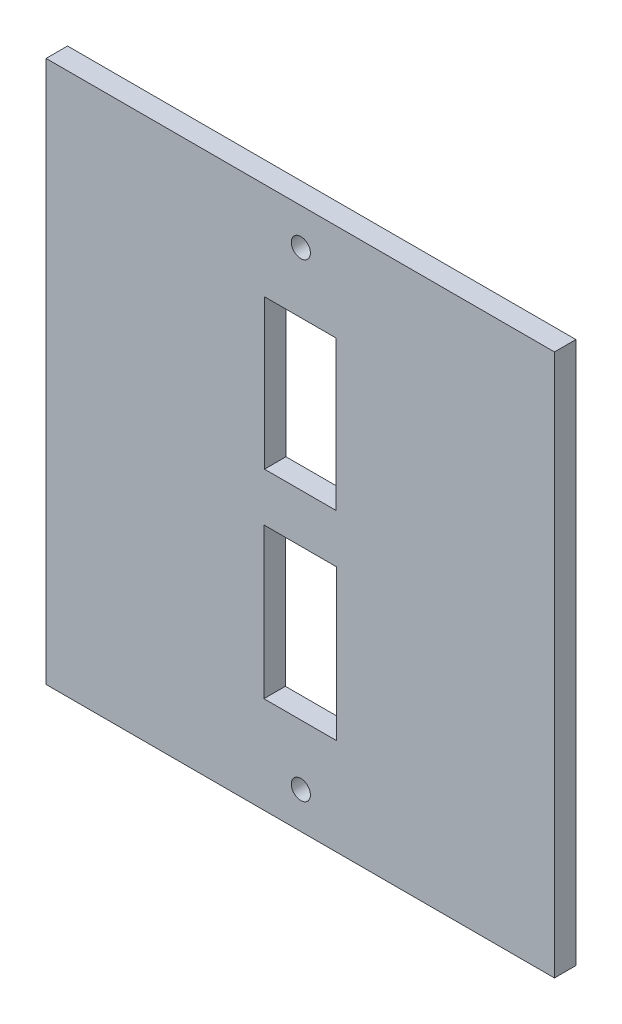
ISO-10303-21;
HEADER;
FILE_DESCRIPTION(('STEP AP214'),'2;1');
FILE_NAME('part.step','',(''),(''),'','','');
FILE_SCHEMA(('AUTOMOTIVE_DESIGN { 1 0 10303 214 1 1 1 1 }'));
ENDSEC;
DATA;
#1=APPLICATION_CONTEXT('core data for automotive mechanical design processes');
#2=APPLICATION_PROTOCOL_DEFINITION('international standard','automotive_design',2000,#1);
#3=PRODUCT_CONTEXT('',#1,'mechanical');
#4=PRODUCT('Part','Part','',(#3));
#5=PRODUCT_RELATED_PRODUCT_CATEGORY('part','',(#4));
#6=PRODUCT_DEFINITION_FORMATION('','',#4);
#7=PRODUCT_DEFINITION_CONTEXT('part definition',#1,'design');
#8=PRODUCT_DEFINITION('design','',#6,#7);
#9=PRODUCT_DEFINITION_SHAPE('','',#8);
#10=(LENGTH_UNIT() NAMED_UNIT(*) SI_UNIT(.MILLI.,.METRE.));
#11=(NAMED_UNIT(*) PLANE_ANGLE_UNIT() SI_UNIT($,.RADIAN.));
#12=(NAMED_UNIT(*) SI_UNIT($,.STERADIAN.) SOLID_ANGLE_UNIT());
#13=UNCERTAINTY_MEASURE_WITH_UNIT(LENGTH_MEASURE(1.E-05),#10,'distance_accuracy_value','');
#14=(GEOMETRIC_REPRESENTATION_CONTEXT(3) GLOBAL_UNCERTAINTY_ASSIGNED_CONTEXT((#13)) GLOBAL_UNIT_ASSIGNED_CONTEXT((#10,
#11,#12)) REPRESENTATION_CONTEXT('',''));
#15=CARTESIAN_POINT('',(0.,0.,0.));
#16=DIRECTION('',(0.,0.,1.));
#17=DIRECTION('',(1.,0.,0.));
#18=AXIS2_PLACEMENT_3D('',#15,#16,#17);
#19=CARTESIAN_POINT('',(0.,0.,3.175));
#20=DIRECTION('',(0.,0.,1.));
#21=DIRECTION('',(1.,0.,0.));
#22=AXIS2_PLACEMENT_3D('',#19,#20,#21);
#23=PLANE('',#22);
#24=CARTESIAN_POINT('',(0.0849999999999913,34.6966991411009,3.175));
#25=DIRECTION('',(0.,0.,1.));
#26=DIRECTION('',(1.,0.,0.));
#27=AXIS2_PLACEMENT_3D('',#24,#25,#26);
#28=CIRCLE('',#27,1.415);
#29=CARTESIAN_POINT('',(1.49999999999999,34.6966991411009,3.175));
#30=VERTEX_POINT('',#29);
#31=EDGE_CURVE('E314',#30,#30,#28,.T.);
#32=ORIENTED_EDGE('',*,*,#31,.F.);
#33=EDGE_LOOP('',(#32));
#34=FACE_BOUND('',#33,.T.);
#35=CARTESIAN_POINT('',(0.0849999999999998,-34.6966991411009,3.175));
#36=DIRECTION('',(0.,0.,1.));
#37=DIRECTION('',(-1.,0.,0.));
#38=AXIS2_PLACEMENT_3D('',#35,#36,#37);
#39=CIRCLE('',#38,1.415);
#40=CARTESIAN_POINT('',(-1.33,-34.6966991411009,3.175));
#41=VERTEX_POINT('',#40);
#42=EDGE_CURVE('E319',#41,#41,#39,.T.);
#43=ORIENTED_EDGE('',*,*,#42,.F.);
#44=EDGE_LOOP('',(#43));
#45=FACE_BOUND('',#44,.T.);
#46=DIRECTION('',(0.,1.,0.));
#47=VECTOR('',#46,1.);
#48=CARTESIAN_POINT('',(37.585,40.085,3.175));
#49=LINE('',#48,#47);
#50=CARTESIAN_POINT('',(37.585,-40.085,3.175));
#51=VERTEX_POINT('',#50);
#52=CARTESIAN_POINT('',(37.585,40.085,3.175));
#53=VERTEX_POINT('',#52);
#54=EDGE_CURVE('E194',#51,#53,#49,.T.);
#55=ORIENTED_EDGE('',*,*,#54,.T.);
#56=DIRECTION('',(-1.,0.,0.));
#57=VECTOR('',#56,1.);
#58=CARTESIAN_POINT('',(-37.585,40.085,3.175));
#59=LINE('',#58,#57);
#60=CARTESIAN_POINT('',(-37.585,40.085,3.175));
#61=VERTEX_POINT('',#60);
#62=EDGE_CURVE('E197',#53,#61,#59,.T.);
#63=ORIENTED_EDGE('',*,*,#62,.T.);
#64=DIRECTION('',(0.,-1.,0.));
#65=VECTOR('',#64,1.);
#66=CARTESIAN_POINT('',(-37.585,40.085,3.175));
#67=LINE('',#66,#65);
#68=CARTESIAN_POINT('',(-37.585,-40.085,3.175));
#69=VERTEX_POINT('',#68);
#70=EDGE_CURVE('E200',#61,#69,#67,.T.);
#71=ORIENTED_EDGE('',*,*,#70,.T.);
#72=DIRECTION('',(1.,0.,0.));
#73=VECTOR('',#72,1.);
#74=CARTESIAN_POINT('',(-37.585,-40.085,3.175));
#75=LINE('',#74,#73);
#76=EDGE_CURVE('E202',#69,#51,#75,.T.);
#77=ORIENTED_EDGE('',*,*,#76,.T.);
#78=EDGE_LOOP('',(#55,#63,#71,#77));
#79=FACE_BOUND('',#78,.T.);
#80=DIRECTION('',(1.,0.,0.));
#81=VECTOR('',#80,1.);
#82=CARTESIAN_POINT('',(-5.37500000000001,-25.8,3.175));
#83=LINE('',#82,#81);
#84=CARTESIAN_POINT('',(-5.37500000000001,-25.8,3.175));
#85=VERTEX_POINT('',#84);
#86=CARTESIAN_POINT('',(5.37499999999999,-25.8,3.175));
#87=VERTEX_POINT('',#86);
#88=EDGE_CURVE('E165',#85,#87,#83,.T.);
#89=ORIENTED_EDGE('',*,*,#88,.F.);
#90=DIRECTION('',(0.,-1.,0.));
#91=VECTOR('',#90,1.);
#92=CARTESIAN_POINT('',(-5.37500000000001,-3.55000000000001,3.175));
#93=LINE('',#92,#91);
#94=CARTESIAN_POINT('',(-5.37500000000001,-3.55000000000001,3.175));
#95=VERTEX_POINT('',#94);
#96=EDGE_CURVE('E163',#95,#85,#93,.T.);
#97=ORIENTED_EDGE('',*,*,#96,.F.);
#98=DIRECTION('',(-1.,0.,0.));
#99=VECTOR('',#98,1.);
#100=CARTESIAN_POINT('',(-5.37500000000001,-3.55000000000001,3.175));
#101=LINE('',#100,#99);
#102=CARTESIAN_POINT('',(5.37499999999999,-3.55000000000001,3.175));
#103=VERTEX_POINT('',#102);
#104=EDGE_CURVE('E171',#103,#95,#101,.T.);
#105=ORIENTED_EDGE('',*,*,#104,.F.);
#106=DIRECTION('',(0.,1.,0.));
#107=VECTOR('',#106,1.);
#108=CARTESIAN_POINT('',(5.37499999999999,-3.55000000000001,3.175));
#109=LINE('',#108,#107);
#110=EDGE_CURVE('E168',#87,#103,#109,.T.);
#111=ORIENTED_EDGE('',*,*,#110,.F.);
#112=EDGE_LOOP('',(#89,#97,#105,#111));
#113=FACE_BOUND('',#112,.T.);
#114=DIRECTION('',(1.,0.,0.));
#115=VECTOR('',#114,1.);
#116=CARTESIAN_POINT('',(-5.29000000000001,3.635,3.175));
#117=LINE('',#116,#115);
#118=CARTESIAN_POINT('',(-5.29000000000001,3.635,3.175));
#119=VERTEX_POINT('',#118);
#120=CARTESIAN_POINT('',(5.28999999999999,3.635,3.175));
#121=VERTEX_POINT('',#120);
#122=EDGE_CURVE('E133',#119,#121,#117,.T.);
#123=ORIENTED_EDGE('',*,*,#122,.F.);
#124=DIRECTION('',(0.,-1.,0.));
#125=VECTOR('',#124,1.);
#126=CARTESIAN_POINT('',(-5.29000000000001,3.635,3.175));
#127=LINE('',#126,#125);
#128=CARTESIAN_POINT('',(-5.29000000000001,25.715,3.175));
#129=VERTEX_POINT('',#128);
#130=EDGE_CURVE('E125',#129,#119,#127,.T.);
#131=ORIENTED_EDGE('',*,*,#130,.F.);
#132=DIRECTION('',(-1.,0.,0.));
#133=VECTOR('',#132,1.);
#134=CARTESIAN_POINT('',(-5.29000000000001,25.715,3.175));
#135=LINE('',#134,#133);
#136=CARTESIAN_POINT('',(5.28999999999999,25.715,3.175));
#137=VERTEX_POINT('',#136);
#138=EDGE_CURVE('E147',#137,#129,#135,.T.);
#139=ORIENTED_EDGE('',*,*,#138,.F.);
#140=DIRECTION('',(0.,1.,0.));
#141=VECTOR('',#140,1.);
#142=CARTESIAN_POINT('',(5.28999999999999,3.635,3.175));
#143=LINE('',#142,#141);
#144=EDGE_CURVE('E145',#121,#137,#143,.T.);
#145=ORIENTED_EDGE('',*,*,#144,.F.);
#146=EDGE_LOOP('',(#123,#131,#139,#145));
#147=FACE_BOUND('',#146,.T.);
#148=ADVANCED_FACE('F36',(#34,#45,#79,#113,#147),#23,.T.);
#149=CARTESIAN_POINT('',(0.,0.,0.));
#150=DIRECTION('',(0.,0.,1.));
#151=DIRECTION('',(1.,0.,0.));
#152=AXIS2_PLACEMENT_3D('',#149,#150,#151);
#153=PLANE('',#152);
#154=CARTESIAN_POINT('',(0.0849999999999913,34.6966991411009,0.));
#155=DIRECTION('',(0.,0.,1.));
#156=DIRECTION('',(1.,0.,0.));
#157=AXIS2_PLACEMENT_3D('',#154,#155,#156);
#158=CIRCLE('',#157,1.415);
#159=CARTESIAN_POINT('',(1.49999999999999,34.6966991411009,0.));
#160=VERTEX_POINT('',#159);
#161=EDGE_CURVE('E153',#160,#160,#158,.T.);
#162=ORIENTED_EDGE('',*,*,#161,.T.);
#163=EDGE_LOOP('',(#162));
#164=FACE_BOUND('',#163,.T.);
#165=CARTESIAN_POINT('',(0.0849999999999998,-34.6966991411009,0.));
#166=DIRECTION('',(0.,0.,1.));
#167=DIRECTION('',(-1.,0.,0.));
#168=AXIS2_PLACEMENT_3D('',#165,#166,#167);
#169=CIRCLE('',#168,1.415);
#170=CARTESIAN_POINT('',(-1.33,-34.6966991411009,0.));
#171=VERTEX_POINT('',#170);
#172=EDGE_CURVE('E315',#171,#171,#169,.T.);
#173=ORIENTED_EDGE('',*,*,#172,.T.);
#174=EDGE_LOOP('',(#173));
#175=FACE_BOUND('',#174,.T.);
#176=DIRECTION('',(0.,-1.,0.));
#177=VECTOR('',#176,1.);
#178=CARTESIAN_POINT('',(-5.37500000000001,-3.55000000000001,0.));
#179=LINE('',#178,#177);
#180=CARTESIAN_POINT('',(-5.37500000000001,-3.55000000000001,0.));
#181=VERTEX_POINT('',#180);
#182=CARTESIAN_POINT('',(-5.37500000000001,-25.8,0.));
#183=VERTEX_POINT('',#182);
#184=EDGE_CURVE('E141',#181,#183,#179,.T.);
#185=ORIENTED_EDGE('',*,*,#184,.T.);
#186=DIRECTION('',(1.,0.,0.));
#187=VECTOR('',#186,1.);
#188=CARTESIAN_POINT('',(-5.37500000000001,-25.8,0.));
#189=LINE('',#188,#187);
#190=CARTESIAN_POINT('',(5.37499999999999,-25.8,0.));
#191=VERTEX_POINT('',#190);
#192=EDGE_CURVE('E176',#183,#191,#189,.T.);
#193=ORIENTED_EDGE('',*,*,#192,.T.);
#194=DIRECTION('',(0.,1.,0.));
#195=VECTOR('',#194,1.);
#196=CARTESIAN_POINT('',(5.37499999999999,-3.55000000000001,0.));
#197=LINE('',#196,#195);
#198=CARTESIAN_POINT('',(5.37499999999999,-3.55000000000001,0.));
#199=VERTEX_POINT('',#198);
#200=EDGE_CURVE('E179',#191,#199,#197,.T.);
#201=ORIENTED_EDGE('',*,*,#200,.T.);
#202=DIRECTION('',(-1.,0.,0.));
#203=VECTOR('',#202,1.);
#204=CARTESIAN_POINT('',(-5.37500000000001,-3.55000000000001,0.));
#205=LINE('',#204,#203);
#206=EDGE_CURVE('E166',#199,#181,#205,.T.);
#207=ORIENTED_EDGE('',*,*,#206,.T.);
#208=EDGE_LOOP('',(#185,#193,#201,#207));
#209=FACE_BOUND('',#208,.T.);
#210=DIRECTION('',(0.,1.,0.));
#211=VECTOR('',#210,1.);
#212=CARTESIAN_POINT('',(37.585,40.085,0.));
#213=LINE('',#212,#211);
#214=CARTESIAN_POINT('',(37.585,-40.085,0.));
#215=VERTEX_POINT('',#214);
#216=CARTESIAN_POINT('',(37.585,40.085,0.));
#217=VERTEX_POINT('',#216);
#218=EDGE_CURVE('E193',#215,#217,#213,.T.);
#219=ORIENTED_EDGE('',*,*,#218,.F.);
#220=DIRECTION('',(1.,0.,0.));
#221=VECTOR('',#220,1.);
#222=CARTESIAN_POINT('',(-37.585,-40.085,0.));
#223=LINE('',#222,#221);
#224=CARTESIAN_POINT('',(-37.585,-40.085,0.));
#225=VERTEX_POINT('',#224);
#226=EDGE_CURVE('E198',#225,#215,#223,.T.);
#227=ORIENTED_EDGE('',*,*,#226,.F.);
#228=DIRECTION('',(0.,-1.,0.));
#229=VECTOR('',#228,1.);
#230=CARTESIAN_POINT('',(-37.585,40.085,0.));
#231=LINE('',#230,#229);
#232=CARTESIAN_POINT('',(-37.585,40.085,0.));
#233=VERTEX_POINT('',#232);
#234=EDGE_CURVE('E209',#233,#225,#231,.T.);
#235=ORIENTED_EDGE('',*,*,#234,.F.);
#236=DIRECTION('',(-1.,0.,0.));
#237=VECTOR('',#236,1.);
#238=CARTESIAN_POINT('',(-37.585,40.085,0.));
#239=LINE('',#238,#237);
#240=EDGE_CURVE('E207',#217,#233,#239,.T.);
#241=ORIENTED_EDGE('',*,*,#240,.F.);
#242=EDGE_LOOP('',(#219,#227,#235,#241));
#243=FACE_BOUND('',#242,.T.);
#244=DIRECTION('',(0.,-1.,0.));
#245=VECTOR('',#244,1.);
#246=CARTESIAN_POINT('',(-5.29000000000001,3.635,0.));
#247=LINE('',#246,#245);
#248=CARTESIAN_POINT('',(-5.29000000000001,25.715,0.));
#249=VERTEX_POINT('',#248);
#250=CARTESIAN_POINT('',(-5.29000000000001,3.635,0.));
#251=VERTEX_POINT('',#250);
#252=EDGE_CURVE('E59',#249,#251,#247,.T.);
#253=ORIENTED_EDGE('',*,*,#252,.T.);
#254=DIRECTION('',(1.,0.,0.));
#255=VECTOR('',#254,1.);
#256=CARTESIAN_POINT('',(-5.29000000000001,3.635,0.));
#257=LINE('',#256,#255);
#258=CARTESIAN_POINT('',(5.28999999999999,3.635,0.));
#259=VERTEX_POINT('',#258);
#260=EDGE_CURVE('E140',#251,#259,#257,.T.);
#261=ORIENTED_EDGE('',*,*,#260,.T.);
#262=DIRECTION('',(0.,1.,0.));
#263=VECTOR('',#262,1.);
#264=CARTESIAN_POINT('',(5.28999999999999,3.635,0.));
#265=LINE('',#264,#263);
#266=CARTESIAN_POINT('',(5.28999999999999,25.715,0.));
#267=VERTEX_POINT('',#266);
#268=EDGE_CURVE('E155',#259,#267,#265,.T.);
#269=ORIENTED_EDGE('',*,*,#268,.T.);
#270=DIRECTION('',(-1.,0.,0.));
#271=VECTOR('',#270,1.);
#272=CARTESIAN_POINT('',(-5.29000000000001,25.715,0.));
#273=LINE('',#272,#271);
#274=EDGE_CURVE('E134',#267,#249,#273,.T.);
#275=ORIENTED_EDGE('',*,*,#274,.T.);
#276=EDGE_LOOP('',(#253,#261,#269,#275));
#277=FACE_BOUND('',#276,.T.);
#278=ADVANCED_FACE('F227',(#164,#175,#209,#243,#277),#153,.F.);
#279=CARTESIAN_POINT('',(37.585,40.085,3.175));
#280=DIRECTION('',(-1.,0.,0.));
#281=DIRECTION('',(0.,0.,1.));
#282=AXIS2_PLACEMENT_3D('',#279,#280,#281);
#283=PLANE('',#282);
#284=ORIENTED_EDGE('',*,*,#218,.T.);
#285=DIRECTION('',(0.,0.,-1.));
#286=VECTOR('',#285,1.);
#287=CARTESIAN_POINT('',(37.585,40.085,3.175));
#288=LINE('',#287,#286);
#289=EDGE_CURVE('E11',#53,#217,#288,.T.);
#290=ORIENTED_EDGE('',*,*,#289,.F.);
#291=ORIENTED_EDGE('',*,*,#54,.F.);
#292=DIRECTION('',(0.,0.,-1.));
#293=VECTOR('',#292,1.);
#294=CARTESIAN_POINT('',(37.585,-40.085,3.175));
#295=LINE('',#294,#293);
#296=EDGE_CURVE('E204',#51,#215,#295,.T.);
#297=ORIENTED_EDGE('',*,*,#296,.T.);
#298=EDGE_LOOP('',(#284,#290,#291,#297));
#299=FACE_BOUND('',#298,.T.);
#300=ADVANCED_FACE('F38',(#299),#283,.F.);
#301=CARTESIAN_POINT('',(-37.585,40.085,3.175));
#302=DIRECTION('',(0.,-1.,0.));
#303=DIRECTION('',(0.,0.,-1.));
#304=AXIS2_PLACEMENT_3D('',#301,#302,#303);
#305=PLANE('',#304);
#306=ORIENTED_EDGE('',*,*,#240,.T.);
#307=DIRECTION('',(0.,0.,-1.));
#308=VECTOR('',#307,1.);
#309=CARTESIAN_POINT('',(-37.585,40.085,3.175));
#310=LINE('',#309,#308);
#311=EDGE_CURVE('E44',#61,#233,#310,.T.);
#312=ORIENTED_EDGE('',*,*,#311,.F.);
#313=ORIENTED_EDGE('',*,*,#62,.F.);
#314=ORIENTED_EDGE('',*,*,#289,.T.);
#315=EDGE_LOOP('',(#306,#312,#313,#314));
#316=FACE_BOUND('',#315,.T.);
#317=ADVANCED_FACE('F238',(#316),#305,.F.);
#318=CARTESIAN_POINT('',(-37.585,40.085,3.175));
#319=DIRECTION('',(1.,0.,0.));
#320=DIRECTION('',(0.,0.,-1.));
#321=AXIS2_PLACEMENT_3D('',#318,#319,#320);
#322=PLANE('',#321);
#323=ORIENTED_EDGE('',*,*,#234,.T.);
#324=DIRECTION('',(0.,0.,-1.));
#325=VECTOR('',#324,1.);
#326=CARTESIAN_POINT('',(-37.585,-40.085,3.175));
#327=LINE('',#326,#325);
#328=EDGE_CURVE('E214',#69,#225,#327,.T.);
#329=ORIENTED_EDGE('',*,*,#328,.F.);
#330=ORIENTED_EDGE('',*,*,#70,.F.);
#331=ORIENTED_EDGE('',*,*,#311,.T.);
#332=EDGE_LOOP('',(#323,#329,#330,#331));
#333=FACE_BOUND('',#332,.T.);
#334=ADVANCED_FACE('F221',(#333),#322,.F.);
#335=CARTESIAN_POINT('',(-37.585,-40.085,3.175));
#336=DIRECTION('',(0.,1.,0.));
#337=DIRECTION('',(0.,0.,1.));
#338=AXIS2_PLACEMENT_3D('',#335,#336,#337);
#339=PLANE('',#338);
#340=ORIENTED_EDGE('',*,*,#226,.T.);
#341=ORIENTED_EDGE('',*,*,#296,.F.);
#342=ORIENTED_EDGE('',*,*,#76,.F.);
#343=ORIENTED_EDGE('',*,*,#328,.T.);
#344=EDGE_LOOP('',(#340,#341,#342,#343));
#345=FACE_BOUND('',#344,.T.);
#346=ADVANCED_FACE('F231',(#345),#339,.F.);
#347=CARTESIAN_POINT('',(-5.37500000000001,-3.55000000000001,3.175));
#348=DIRECTION('',(1.,0.,0.));
#349=DIRECTION('',(0.,0.,-1.));
#350=AXIS2_PLACEMENT_3D('',#347,#348,#349);
#351=PLANE('',#350);
#352=ORIENTED_EDGE('',*,*,#184,.F.);
#353=DIRECTION('',(0.,0.,-1.));
#354=VECTOR('',#353,1.);
#355=CARTESIAN_POINT('',(-5.37500000000001,-3.55000000000001,3.175));
#356=LINE('',#355,#354);
#357=EDGE_CURVE('E173',#95,#181,#356,.T.);
#358=ORIENTED_EDGE('',*,*,#357,.F.);
#359=ORIENTED_EDGE('',*,*,#96,.T.);
#360=DIRECTION('',(0.,0.,-1.));
#361=VECTOR('',#360,1.);
#362=CARTESIAN_POINT('',(-5.37500000000001,-25.8,3.175));
#363=LINE('',#362,#361);
#364=EDGE_CURVE('E190',#85,#183,#363,.T.);
#365=ORIENTED_EDGE('',*,*,#364,.T.);
#366=EDGE_LOOP('',(#352,#358,#359,#365));
#367=FACE_BOUND('',#366,.T.);
#368=ADVANCED_FACE('F256',(#367),#351,.T.);
#369=CARTESIAN_POINT('',(-5.37500000000001,-25.8,3.175));
#370=DIRECTION('',(0.,1.,0.));
#371=DIRECTION('',(0.,0.,1.));
#372=AXIS2_PLACEMENT_3D('',#369,#370,#371);
#373=PLANE('',#372);
#374=ORIENTED_EDGE('',*,*,#192,.F.);
#375=ORIENTED_EDGE('',*,*,#364,.F.);
#376=ORIENTED_EDGE('',*,*,#88,.T.);
#377=DIRECTION('',(0.,0.,-1.));
#378=VECTOR('',#377,1.);
#379=CARTESIAN_POINT('',(5.37499999999999,-25.8,3.175));
#380=LINE('',#379,#378);
#381=EDGE_CURVE('E188',#87,#191,#380,.T.);
#382=ORIENTED_EDGE('',*,*,#381,.T.);
#383=EDGE_LOOP('',(#374,#375,#376,#382));
#384=FACE_BOUND('',#383,.T.);
#385=ADVANCED_FACE('F263',(#384),#373,.T.);
#386=CARTESIAN_POINT('',(5.37499999999999,-3.55000000000001,3.175));
#387=DIRECTION('',(-1.,0.,0.));
#388=DIRECTION('',(0.,0.,1.));
#389=AXIS2_PLACEMENT_3D('',#386,#387,#388);
#390=PLANE('',#389);
#391=ORIENTED_EDGE('',*,*,#200,.F.);
#392=ORIENTED_EDGE('',*,*,#381,.F.);
#393=ORIENTED_EDGE('',*,*,#110,.T.);
#394=DIRECTION('',(0.,0.,-1.));
#395=VECTOR('',#394,1.);
#396=CARTESIAN_POINT('',(5.37499999999999,-3.55000000000001,3.175));
#397=LINE('',#396,#395);
#398=EDGE_CURVE('E186',#103,#199,#397,.T.);
#399=ORIENTED_EDGE('',*,*,#398,.T.);
#400=EDGE_LOOP('',(#391,#392,#393,#399));
#401=FACE_BOUND('',#400,.T.);
#402=ADVANCED_FACE('F268',(#401),#390,.T.);
#403=CARTESIAN_POINT('',(-5.37500000000001,-3.55000000000001,3.175));
#404=DIRECTION('',(0.,-1.,0.));
#405=DIRECTION('',(0.,0.,-1.));
#406=AXIS2_PLACEMENT_3D('',#403,#404,#405);
#407=PLANE('',#406);
#408=ORIENTED_EDGE('',*,*,#206,.F.);
#409=ORIENTED_EDGE('',*,*,#398,.F.);
#410=ORIENTED_EDGE('',*,*,#104,.T.);
#411=ORIENTED_EDGE('',*,*,#357,.T.);
#412=EDGE_LOOP('',(#408,#409,#410,#411));
#413=FACE_BOUND('',#412,.T.);
#414=ADVANCED_FACE('F276',(#413),#407,.T.);
#415=CARTESIAN_POINT('',(-5.29000000000001,3.635,3.175));
#416=DIRECTION('',(1.,0.,0.));
#417=DIRECTION('',(0.,0.,-1.));
#418=AXIS2_PLACEMENT_3D('',#415,#416,#417);
#419=PLANE('',#418);
#420=ORIENTED_EDGE('',*,*,#252,.F.);
#421=DIRECTION('',(0.,0.,-1.));
#422=VECTOR('',#421,1.);
#423=CARTESIAN_POINT('',(-5.29000000000001,25.715,3.175));
#424=LINE('',#423,#422);
#425=EDGE_CURVE('E129',#129,#249,#424,.T.);
#426=ORIENTED_EDGE('',*,*,#425,.F.);
#427=ORIENTED_EDGE('',*,*,#130,.T.);
#428=DIRECTION('',(0.,0.,-1.));
#429=VECTOR('',#428,1.);
#430=CARTESIAN_POINT('',(-5.29000000000001,3.635,3.175));
#431=LINE('',#430,#429);
#432=EDGE_CURVE('E128',#119,#251,#431,.T.);
#433=ORIENTED_EDGE('',*,*,#432,.T.);
#434=EDGE_LOOP('',(#420,#426,#427,#433));
#435=FACE_BOUND('',#434,.T.);
#436=ADVANCED_FACE('F127',(#435),#419,.T.);
#437=CARTESIAN_POINT('',(-5.29000000000001,3.635,3.175));
#438=DIRECTION('',(0.,1.,0.));
#439=DIRECTION('',(0.,0.,1.));
#440=AXIS2_PLACEMENT_3D('',#437,#438,#439);
#441=PLANE('',#440);
#442=ORIENTED_EDGE('',*,*,#260,.F.);
#443=ORIENTED_EDGE('',*,*,#432,.F.);
#444=ORIENTED_EDGE('',*,*,#122,.T.);
#445=DIRECTION('',(0.,0.,-1.));
#446=VECTOR('',#445,1.);
#447=CARTESIAN_POINT('',(5.28999999999999,3.635,3.175));
#448=LINE('',#447,#446);
#449=EDGE_CURVE('E142',#121,#259,#448,.T.);
#450=ORIENTED_EDGE('',*,*,#449,.T.);
#451=EDGE_LOOP('',(#442,#443,#444,#450));
#452=FACE_BOUND('',#451,.T.);
#453=ADVANCED_FACE('F137',(#452),#441,.T.);
#454=CARTESIAN_POINT('',(5.28999999999999,3.635,3.175));
#455=DIRECTION('',(-1.,0.,0.));
#456=DIRECTION('',(0.,0.,1.));
#457=AXIS2_PLACEMENT_3D('',#454,#455,#456);
#458=PLANE('',#457);
#459=ORIENTED_EDGE('',*,*,#268,.F.);
#460=ORIENTED_EDGE('',*,*,#449,.F.);
#461=ORIENTED_EDGE('',*,*,#144,.T.);
#462=DIRECTION('',(0.,0.,-1.));
#463=VECTOR('',#462,1.);
#464=CARTESIAN_POINT('',(5.28999999999999,25.715,3.175));
#465=LINE('',#464,#463);
#466=EDGE_CURVE('E51',#137,#267,#465,.T.);
#467=ORIENTED_EDGE('',*,*,#466,.T.);
#468=EDGE_LOOP('',(#459,#460,#461,#467));
#469=FACE_BOUND('',#468,.T.);
#470=ADVANCED_FACE('F294',(#469),#458,.T.);
#471=CARTESIAN_POINT('',(-5.29000000000001,25.715,3.175));
#472=DIRECTION('',(0.,-1.,0.));
#473=DIRECTION('',(0.,0.,-1.));
#474=AXIS2_PLACEMENT_3D('',#471,#472,#473);
#475=PLANE('',#474);
#476=ORIENTED_EDGE('',*,*,#274,.F.);
#477=ORIENTED_EDGE('',*,*,#466,.F.);
#478=ORIENTED_EDGE('',*,*,#138,.T.);
#479=ORIENTED_EDGE('',*,*,#425,.T.);
#480=EDGE_LOOP('',(#476,#477,#478,#479));
#481=FACE_BOUND('',#480,.T.);
#482=ADVANCED_FACE('F297',(#481),#475,.T.);
#483=CARTESIAN_POINT('',(0.0849999999999998,-34.6966991411009,0.));
#484=DIRECTION('',(0.,0.,1.));
#485=DIRECTION('',(1.,0.,0.));
#486=AXIS2_PLACEMENT_3D('',#483,#484,#485);
#487=CYLINDRICAL_SURFACE('',#486,1.415);
#488=ORIENTED_EDGE('',*,*,#172,.F.);
#489=EDGE_LOOP('',(#488));
#490=FACE_BOUND('',#489,.T.);
#491=ORIENTED_EDGE('',*,*,#42,.T.);
#492=EDGE_LOOP('',(#491));
#493=FACE_BOUND('',#492,.T.);
#494=ADVANCED_FACE('F301',(#490,#493),#487,.F.);
#495=CARTESIAN_POINT('',(0.0849999999999913,34.6966991411009,0.));
#496=DIRECTION('',(0.,0.,1.));
#497=DIRECTION('',(1.,0.,0.));
#498=AXIS2_PLACEMENT_3D('',#495,#496,#497);
#499=CYLINDRICAL_SURFACE('',#498,1.415);
#500=ORIENTED_EDGE('',*,*,#161,.F.);
#501=EDGE_LOOP('',(#500));
#502=FACE_BOUND('',#501,.T.);
#503=ORIENTED_EDGE('',*,*,#31,.T.);
#504=EDGE_LOOP('',(#503));
#505=FACE_BOUND('',#504,.T.);
#506=ADVANCED_FACE('F304',(#502,#505),#499,.F.);
#507=CLOSED_SHELL('',(#148,#278,#300,#317,#334,#346,#368,#385,#402,#414,#436,#453,#470,#482,
#494,#506));
#508=MANIFOLD_SOLID_BREP('B2',#507);
#509=ADVANCED_BREP_SHAPE_REPRESENTATION('',(#18,#508),#14);
#510=SHAPE_DEFINITION_REPRESENTATION(#9,#509);
ENDSEC;
END-ISO-10303-21;
